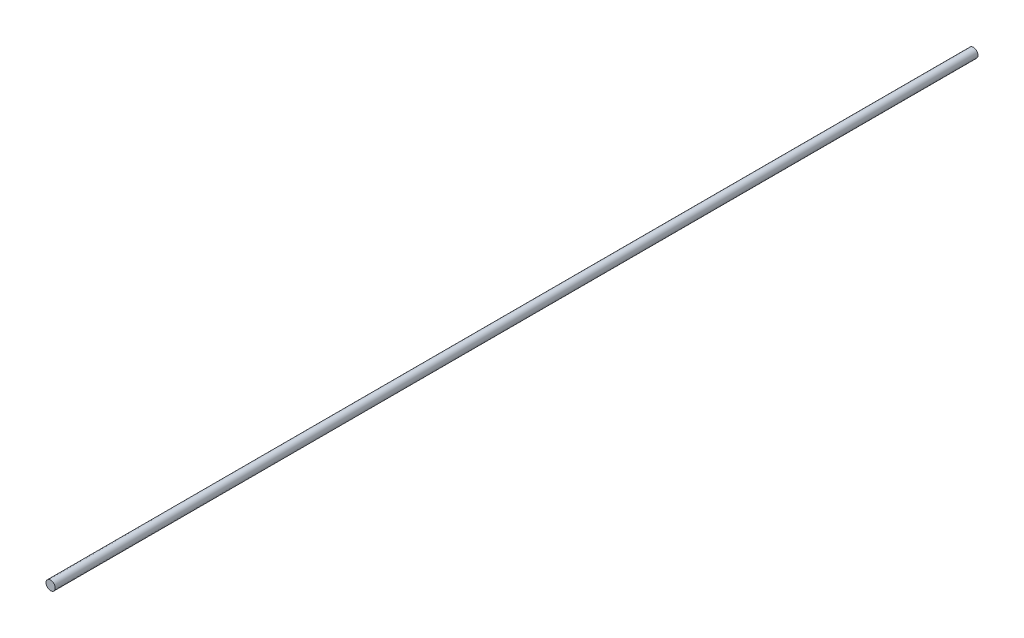
ISO-10303-21;
HEADER;
FILE_DESCRIPTION(('STEP AP214'),'2;1');
FILE_NAME('part.step','',(''),(''),'','','');
FILE_SCHEMA(('AUTOMOTIVE_DESIGN { 1 0 10303 214 1 1 1 1 }'));
ENDSEC;
DATA;
#1=APPLICATION_CONTEXT('core data for automotive mechanical design processes');
#2=APPLICATION_PROTOCOL_DEFINITION('international standard','automotive_design',2000,#1);
#3=PRODUCT_CONTEXT('',#1,'mechanical');
#4=PRODUCT('Part','Part','',(#3));
#5=PRODUCT_RELATED_PRODUCT_CATEGORY('part','',(#4));
#6=PRODUCT_DEFINITION_FORMATION('','',#4);
#7=PRODUCT_DEFINITION_CONTEXT('part definition',#1,'design');
#8=PRODUCT_DEFINITION('design','',#6,#7);
#9=PRODUCT_DEFINITION_SHAPE('','',#8);
#10=(LENGTH_UNIT() NAMED_UNIT(*) SI_UNIT(.MILLI.,.METRE.));
#11=(NAMED_UNIT(*) PLANE_ANGLE_UNIT() SI_UNIT($,.RADIAN.));
#12=(NAMED_UNIT(*) SI_UNIT($,.STERADIAN.) SOLID_ANGLE_UNIT());
#13=UNCERTAINTY_MEASURE_WITH_UNIT(LENGTH_MEASURE(1.E-05),#10,'distance_accuracy_value','');
#14=(GEOMETRIC_REPRESENTATION_CONTEXT(3) GLOBAL_UNCERTAINTY_ASSIGNED_CONTEXT((#13)) GLOBAL_UNIT_ASSIGNED_CONTEXT((#10,
#11,#12)) REPRESENTATION_CONTEXT('',''));
#15=CARTESIAN_POINT('',(0.,0.,0.));
#16=DIRECTION('',(0.,0.,1.));
#17=DIRECTION('',(1.,0.,0.));
#18=AXIS2_PLACEMENT_3D('',#15,#16,#17);
#19=CARTESIAN_POINT('',(0.,0.,200.));
#20=DIRECTION('',(0.,0.,-1.));
#21=DIRECTION('',(-1.,0.,0.));
#22=AXIS2_PLACEMENT_3D('',#19,#20,#21);
#23=CYLINDRICAL_SURFACE('',#22,1.);
#24=CARTESIAN_POINT('',(0.,0.,200.));
#25=DIRECTION('',(0.,0.,1.));
#26=DIRECTION('',(1.,0.,0.));
#27=AXIS2_PLACEMENT_3D('',#24,#25,#26);
#28=CIRCLE('',#27,1.);
#29=CARTESIAN_POINT('',(1.,0.,200.));
#30=VERTEX_POINT('',#29);
#31=EDGE_CURVE('E10',#30,#30,#28,.T.);
#32=ORIENTED_EDGE('',*,*,#31,.F.);
#33=EDGE_LOOP('',(#32));
#34=FACE_BOUND('',#33,.T.);
#35=CARTESIAN_POINT('',(0.,0.,0.));
#36=DIRECTION('',(0.,0.,1.));
#37=DIRECTION('',(1.,0.,0.));
#38=AXIS2_PLACEMENT_3D('',#35,#36,#37);
#39=CIRCLE('',#38,1.);
#40=CARTESIAN_POINT('',(1.,0.,0.));
#41=VERTEX_POINT('',#40);
#42=EDGE_CURVE('E40',#41,#41,#39,.T.);
#43=ORIENTED_EDGE('',*,*,#42,.T.);
#44=EDGE_LOOP('',(#43));
#45=FACE_BOUND('',#44,.T.);
#46=ADVANCED_FACE('F37',(#34,#45),#23,.T.);
#47=CARTESIAN_POINT('',(0.,0.,200.));
#48=DIRECTION('',(0.,0.,1.));
#49=DIRECTION('',(1.,0.,0.));
#50=AXIS2_PLACEMENT_3D('',#47,#48,#49);
#51=PLANE('',#50);
#52=ORIENTED_EDGE('',*,*,#31,.T.);
#53=EDGE_LOOP('',(#52));
#54=FACE_BOUND('',#53,.T.);
#55=ADVANCED_FACE('F54',(#54),#51,.T.);
#56=CARTESIAN_POINT('',(0.,0.,0.));
#57=DIRECTION('',(0.,0.,1.));
#58=DIRECTION('',(1.,0.,0.));
#59=AXIS2_PLACEMENT_3D('',#56,#57,#58);
#60=PLANE('',#59);
#61=ORIENTED_EDGE('',*,*,#42,.F.);
#62=EDGE_LOOP('',(#61));
#63=FACE_BOUND('',#62,.T.);
#64=ADVANCED_FACE('F52',(#63),#60,.F.);
#65=CLOSED_SHELL('',(#46,#55,#64));
#66=MANIFOLD_SOLID_BREP('B2',#65);
#67=ADVANCED_BREP_SHAPE_REPRESENTATION('',(#18,#66),#14);
#68=SHAPE_DEFINITION_REPRESENTATION(#9,#67);
ENDSEC;
END-ISO-10303-21;
